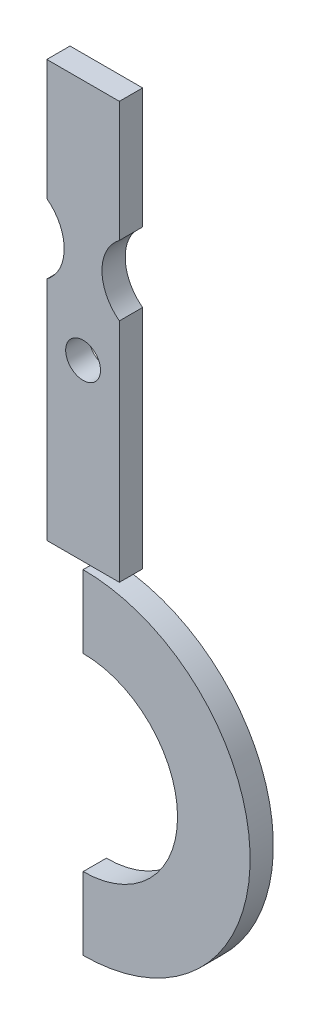
ISO-10303-21;
HEADER;
FILE_DESCRIPTION(('STEP AP214'),'2;1');
FILE_NAME('part.step','',(''),(''),'','','');
FILE_SCHEMA(('AUTOMOTIVE_DESIGN { 1 0 10303 214 1 1 1 1 }'));
ENDSEC;
DATA;
#1=APPLICATION_CONTEXT('core data for automotive mechanical design processes');
#2=APPLICATION_PROTOCOL_DEFINITION('international standard','automotive_design',2000,#1);
#3=PRODUCT_CONTEXT('',#1,'mechanical');
#4=PRODUCT('Part','Part','',(#3));
#5=PRODUCT_RELATED_PRODUCT_CATEGORY('part','',(#4));
#6=PRODUCT_DEFINITION_FORMATION('','',#4);
#7=PRODUCT_DEFINITION_CONTEXT('part definition',#1,'design');
#8=PRODUCT_DEFINITION('design','',#6,#7);
#9=PRODUCT_DEFINITION_SHAPE('','',#8);
#10=(LENGTH_UNIT() NAMED_UNIT(*) SI_UNIT(.MILLI.,.METRE.));
#11=(NAMED_UNIT(*) PLANE_ANGLE_UNIT() SI_UNIT($,.RADIAN.));
#12=(NAMED_UNIT(*) SI_UNIT($,.STERADIAN.) SOLID_ANGLE_UNIT());
#13=UNCERTAINTY_MEASURE_WITH_UNIT(LENGTH_MEASURE(1.E-05),#10,'distance_accuracy_value','');
#14=(GEOMETRIC_REPRESENTATION_CONTEXT(3) GLOBAL_UNCERTAINTY_ASSIGNED_CONTEXT((#13)) GLOBAL_UNIT_ASSIGNED_CONTEXT((#10,
#11,#12)) REPRESENTATION_CONTEXT('',''));
#15=CARTESIAN_POINT('',(0.,0.,0.));
#16=DIRECTION('',(0.,0.,1.));
#17=DIRECTION('',(1.,0.,0.));
#18=AXIS2_PLACEMENT_3D('',#15,#16,#17);
#19=CARTESIAN_POINT('',(0.,-185.,8.));
#20=DIRECTION('',(0.,0.,-1.));
#21=DIRECTION('',(-1.,0.,0.));
#22=AXIS2_PLACEMENT_3D('',#19,#20,#21);
#23=CYLINDRICAL_SURFACE('',#22,32.5433285968467);
#24=CARTESIAN_POINT('',(0.,-185.,0.));
#25=DIRECTION('',(0.,0.,1.));
#26=DIRECTION('',(1.,0.,0.));
#27=AXIS2_PLACEMENT_3D('',#24,#25,#26);
#28=CIRCLE('',#27,32.5433285968467);
#29=CARTESIAN_POINT('',(0.,-152.456671403153,0.));
#30=VERTEX_POINT('',#29);
#31=CARTESIAN_POINT('',(0.,-217.543328596847,0.));
#32=VERTEX_POINT('',#31);
#33=EDGE_CURVE('E133',#30,#32,#28,.F.);
#34=ORIENTED_EDGE('',*,*,#33,.T.);
#35=DIRECTION('',(0.,0.,-1.));
#36=VECTOR('',#35,1.);
#37=CARTESIAN_POINT('',(0.,-217.543328596847,8.));
#38=LINE('',#37,#36);
#39=CARTESIAN_POINT('',(0.,-217.543328596847,8.));
#40=VERTEX_POINT('',#39);
#41=EDGE_CURVE('E13',#40,#32,#38,.T.);
#42=ORIENTED_EDGE('',*,*,#41,.F.);
#43=CARTESIAN_POINT('',(0.,-185.,8.));
#44=DIRECTION('',(0.,0.,1.));
#45=DIRECTION('',(1.,0.,0.));
#46=AXIS2_PLACEMENT_3D('',#43,#44,#45);
#47=CIRCLE('',#46,32.5433285968467);
#48=CARTESIAN_POINT('',(0.,-152.456671403153,8.));
#49=VERTEX_POINT('',#48);
#50=EDGE_CURVE('E104',#49,#40,#47,.F.);
#51=ORIENTED_EDGE('',*,*,#50,.F.);
#52=DIRECTION('',(0.,0.,-1.));
#53=VECTOR('',#52,1.);
#54=CARTESIAN_POINT('',(0.,-152.456671403153,8.));
#55=LINE('',#54,#53);
#56=EDGE_CURVE('E132',#49,#30,#55,.T.);
#57=ORIENTED_EDGE('',*,*,#56,.T.);
#58=EDGE_LOOP('',(#34,#42,#51,#57));
#59=FACE_BOUND('',#58,.T.);
#60=ADVANCED_FACE('F61',(#59),#23,.F.);
#61=CARTESIAN_POINT('',(0.,0.,8.));
#62=DIRECTION('',(-1.,0.,0.));
#63=DIRECTION('',(0.,-1.,0.));
#64=AXIS2_PLACEMENT_3D('',#61,#62,#63);
#65=PLANE('',#64);
#66=DIRECTION('',(0.,1.,0.));
#67=VECTOR('',#66,1.);
#68=CARTESIAN_POINT('',(0.,0.,0.));
#69=LINE('',#68,#67);
#70=CARTESIAN_POINT('',(0.,-242.543328596847,0.));
#71=VERTEX_POINT('',#70);
#72=EDGE_CURVE('E114',#71,#32,#69,.T.);
#73=ORIENTED_EDGE('',*,*,#72,.F.);
#74=DIRECTION('',(0.,0.,-1.));
#75=VECTOR('',#74,1.);
#76=CARTESIAN_POINT('',(0.,-242.543328596847,8.));
#77=LINE('',#76,#75);
#78=CARTESIAN_POINT('',(0.,-242.543328596847,8.));
#79=VERTEX_POINT('',#78);
#80=EDGE_CURVE('E70',#79,#71,#77,.T.);
#81=ORIENTED_EDGE('',*,*,#80,.F.);
#82=DIRECTION('',(0.,1.,0.));
#83=VECTOR('',#82,1.);
#84=CARTESIAN_POINT('',(0.,0.,8.));
#85=LINE('',#84,#83);
#86=EDGE_CURVE('E112',#79,#40,#85,.T.);
#87=ORIENTED_EDGE('',*,*,#86,.T.);
#88=ORIENTED_EDGE('',*,*,#41,.T.);
#89=EDGE_LOOP('',(#73,#81,#87,#88));
#90=FACE_BOUND('',#89,.T.);
#91=ADVANCED_FACE('F111',(#90),#65,.T.);
#92=CARTESIAN_POINT('',(0.,-185.,8.));
#93=DIRECTION('',(0.,0.,-1.));
#94=DIRECTION('',(-1.,0.,0.));
#95=AXIS2_PLACEMENT_3D('',#92,#93,#94);
#96=CYLINDRICAL_SURFACE('',#95,57.5433285968466);
#97=CARTESIAN_POINT('',(0.,-185.,0.));
#98=DIRECTION('',(0.,0.,1.));
#99=DIRECTION('',(1.,0.,0.));
#100=AXIS2_PLACEMENT_3D('',#97,#98,#99);
#101=CIRCLE('',#100,57.5433285968466);
#102=CARTESIAN_POINT('',(0.,-127.456671403153,0.));
#103=VERTEX_POINT('',#102);
#104=EDGE_CURVE('E93',#71,#103,#101,.T.);
#105=ORIENTED_EDGE('',*,*,#104,.T.);
#106=DIRECTION('',(0.,0.,-1.));
#107=VECTOR('',#106,1.);
#108=CARTESIAN_POINT('',(0.,-127.456671403153,8.));
#109=LINE('',#108,#107);
#110=CARTESIAN_POINT('',(0.,-127.456671403153,8.));
#111=VERTEX_POINT('',#110);
#112=EDGE_CURVE('E116',#111,#103,#109,.T.);
#113=ORIENTED_EDGE('',*,*,#112,.F.);
#114=CARTESIAN_POINT('',(0.,-185.,8.));
#115=DIRECTION('',(0.,0.,1.));
#116=DIRECTION('',(1.,0.,0.));
#117=AXIS2_PLACEMENT_3D('',#114,#115,#116);
#118=CIRCLE('',#117,57.5433285968466);
#119=EDGE_CURVE('E117',#79,#111,#118,.T.);
#120=ORIENTED_EDGE('',*,*,#119,.F.);
#121=ORIENTED_EDGE('',*,*,#80,.T.);
#122=EDGE_LOOP('',(#105,#113,#120,#121));
#123=FACE_BOUND('',#122,.T.);
#124=ADVANCED_FACE('F118',(#123),#96,.T.);
#125=CARTESIAN_POINT('',(0.,0.,8.));
#126=DIRECTION('',(1.,0.,0.));
#127=DIRECTION('',(0.,1.,0.));
#128=AXIS2_PLACEMENT_3D('',#125,#126,#127);
#129=PLANE('',#128);
#130=DIRECTION('',(0.,-1.,0.));
#131=VECTOR('',#130,1.);
#132=CARTESIAN_POINT('',(0.,0.,0.));
#133=LINE('',#132,#131);
#134=EDGE_CURVE('E99',#103,#30,#133,.T.);
#135=ORIENTED_EDGE('',*,*,#134,.T.);
#136=ORIENTED_EDGE('',*,*,#56,.F.);
#137=DIRECTION('',(0.,-1.,0.));
#138=VECTOR('',#137,1.);
#139=CARTESIAN_POINT('',(0.,0.,8.));
#140=LINE('',#139,#138);
#141=EDGE_CURVE('E78',#111,#49,#140,.T.);
#142=ORIENTED_EDGE('',*,*,#141,.F.);
#143=ORIENTED_EDGE('',*,*,#112,.T.);
#144=EDGE_LOOP('',(#135,#136,#142,#143));
#145=FACE_BOUND('',#144,.T.);
#146=ADVANCED_FACE('F146',(#145),#129,.F.);
#147=CARTESIAN_POINT('',(0.,0.,8.));
#148=DIRECTION('',(0.,0.,1.));
#149=DIRECTION('',(1.,0.,0.));
#150=AXIS2_PLACEMENT_3D('',#147,#148,#149);
#151=PLANE('',#150);
#152=ORIENTED_EDGE('',*,*,#50,.T.);
#153=ORIENTED_EDGE('',*,*,#86,.F.);
#154=ORIENTED_EDGE('',*,*,#119,.T.);
#155=ORIENTED_EDGE('',*,*,#141,.T.);
#156=EDGE_LOOP('',(#152,#153,#154,#155));
#157=FACE_BOUND('',#156,.T.);
#158=ADVANCED_FACE('F121',(#157),#151,.T.);
#159=CARTESIAN_POINT('',(0.,0.,0.));
#160=DIRECTION('',(0.,0.,1.));
#161=DIRECTION('',(1.,0.,0.));
#162=AXIS2_PLACEMENT_3D('',#159,#160,#161);
#163=PLANE('',#162);
#164=ORIENTED_EDGE('',*,*,#33,.F.);
#165=ORIENTED_EDGE('',*,*,#134,.F.);
#166=ORIENTED_EDGE('',*,*,#104,.F.);
#167=ORIENTED_EDGE('',*,*,#72,.T.);
#168=EDGE_LOOP('',(#164,#165,#166,#167));
#169=FACE_BOUND('',#168,.T.);
#170=ADVANCED_FACE('F149',(#169),#163,.F.);
#171=CLOSED_SHELL('',(#60,#91,#124,#146,#158,#170));
#172=MANIFOLD_SOLID_BREP('B2',#171);
#173=CARTESIAN_POINT('',(21.5,-35.,8.));
#174=DIRECTION('',(0.,0.,-1.));
#175=DIRECTION('',(-1.,0.,0.));
#176=AXIS2_PLACEMENT_3D('',#173,#174,#175);
#177=CYLINDRICAL_SURFACE('',#176,15.);
#178=CARTESIAN_POINT('',(21.5,-35.,0.));
#179=DIRECTION('',(0.,0.,1.));
#180=DIRECTION('',(1.,0.,0.));
#181=AXIS2_PLACEMENT_3D('',#178,#179,#180);
#182=CIRCLE('',#181,15.);
#183=CARTESIAN_POINT('',(12.5,-23.,0.));
#184=VERTEX_POINT('',#183);
#185=CARTESIAN_POINT('',(12.5,-47.,0.));
#186=VERTEX_POINT('',#185);
#187=EDGE_CURVE('E367',#184,#186,#182,.T.);
#188=ORIENTED_EDGE('',*,*,#187,.F.);
#189=DIRECTION('',(0.,0.,-1.));
#190=VECTOR('',#189,1.);
#191=CARTESIAN_POINT('',(12.5,-23.,8.));
#192=LINE('',#191,#190);
#193=CARTESIAN_POINT('',(12.5,-23.,8.));
#194=VERTEX_POINT('',#193);
#195=EDGE_CURVE('E59',#194,#184,#192,.T.);
#196=ORIENTED_EDGE('',*,*,#195,.F.);
#197=CARTESIAN_POINT('',(21.5,-35.,8.));
#198=DIRECTION('',(0.,0.,1.));
#199=DIRECTION('',(1.,0.,0.));
#200=AXIS2_PLACEMENT_3D('',#197,#198,#199);
#201=CIRCLE('',#200,15.);
#202=CARTESIAN_POINT('',(12.5,-47.,8.));
#203=VERTEX_POINT('',#202);
#204=EDGE_CURVE('E327',#194,#203,#201,.T.);
#205=ORIENTED_EDGE('',*,*,#204,.T.);
#206=DIRECTION('',(0.,0.,-1.));
#207=VECTOR('',#206,1.);
#208=CARTESIAN_POINT('',(12.5,-47.,8.));
#209=LINE('',#208,#207);
#210=EDGE_CURVE('E225',#203,#186,#209,.T.);
#211=ORIENTED_EDGE('',*,*,#210,.T.);
#212=EDGE_LOOP('',(#188,#196,#205,#211));
#213=FACE_BOUND('',#212,.T.);
#214=ADVANCED_FACE('F208',(#213),#177,.F.);
#215=CARTESIAN_POINT('',(12.5,0.,8.));
#216=DIRECTION('',(1.,0.,0.));
#217=DIRECTION('',(0.,1.,0.));
#218=AXIS2_PLACEMENT_3D('',#215,#216,#217);
#219=PLANE('',#218);
#220=DIRECTION('',(0.,-1.,0.));
#221=VECTOR('',#220,1.);
#222=CARTESIAN_POINT('',(12.5,0.,0.));
#223=LINE('',#222,#221);
#224=CARTESIAN_POINT('',(12.5,18.5,0.));
#225=VERTEX_POINT('',#224);
#226=EDGE_CURVE('E365',#225,#184,#223,.T.);
#227=ORIENTED_EDGE('',*,*,#226,.F.);
#228=DIRECTION('',(0.,0.,-1.));
#229=VECTOR('',#228,1.);
#230=CARTESIAN_POINT('',(12.5,18.5,8.));
#231=LINE('',#230,#229);
#232=CARTESIAN_POINT('',(12.5,18.5,8.));
#233=VERTEX_POINT('',#232);
#234=EDGE_CURVE('E217',#233,#225,#231,.T.);
#235=ORIENTED_EDGE('',*,*,#234,.F.);
#236=DIRECTION('',(0.,-1.,0.));
#237=VECTOR('',#236,1.);
#238=CARTESIAN_POINT('',(12.5,0.,8.));
#239=LINE('',#238,#237);
#240=EDGE_CURVE('E324',#233,#194,#239,.T.);
#241=ORIENTED_EDGE('',*,*,#240,.T.);
#242=ORIENTED_EDGE('',*,*,#195,.T.);
#243=EDGE_LOOP('',(#227,#235,#241,#242));
#244=FACE_BOUND('',#243,.T.);
#245=ADVANCED_FACE('F366',(#244),#219,.T.);
#246=CARTESIAN_POINT('',(0.,18.5,8.));
#247=DIRECTION('',(0.,1.,0.));
#248=DIRECTION('',(0.,0.,1.));
#249=AXIS2_PLACEMENT_3D('',#246,#247,#248);
#250=PLANE('',#249);
#251=DIRECTION('',(1.,0.,0.));
#252=VECTOR('',#251,1.);
#253=CARTESIAN_POINT('',(0.,18.5,0.));
#254=LINE('',#253,#252);
#255=CARTESIAN_POINT('',(-12.5,18.5,0.));
#256=VERTEX_POINT('',#255);
#257=EDGE_CURVE('E359',#256,#225,#254,.T.);
#258=ORIENTED_EDGE('',*,*,#257,.F.);
#259=DIRECTION('',(0.,0.,-1.));
#260=VECTOR('',#259,1.);
#261=CARTESIAN_POINT('',(-12.5,18.5,8.));
#262=LINE('',#261,#260);
#263=CARTESIAN_POINT('',(-12.5,18.5,8.));
#264=VERTEX_POINT('',#263);
#265=EDGE_CURVE('E353',#264,#256,#262,.T.);
#266=ORIENTED_EDGE('',*,*,#265,.F.);
#267=DIRECTION('',(1.,0.,0.));
#268=VECTOR('',#267,1.);
#269=CARTESIAN_POINT('',(0.,18.5,8.));
#270=LINE('',#269,#268);
#271=EDGE_CURVE('E317',#264,#233,#270,.T.);
#272=ORIENTED_EDGE('',*,*,#271,.T.);
#273=ORIENTED_EDGE('',*,*,#234,.T.);
#274=EDGE_LOOP('',(#258,#266,#272,#273));
#275=FACE_BOUND('',#274,.T.);
#276=ADVANCED_FACE('F357',(#275),#250,.T.);
#277=CARTESIAN_POINT('',(-12.5,0.,8.));
#278=DIRECTION('',(-1.,0.,0.));
#279=DIRECTION('',(0.,0.,1.));
#280=AXIS2_PLACEMENT_3D('',#277,#278,#279);
#281=PLANE('',#280);
#282=DIRECTION('',(0.,1.,0.));
#283=VECTOR('',#282,1.);
#284=CARTESIAN_POINT('',(-12.5,0.,0.));
#285=LINE('',#284,#283);
#286=CARTESIAN_POINT('',(-12.5,-23.,0.));
#287=VERTEX_POINT('',#286);
#288=EDGE_CURVE('E372',#287,#256,#285,.T.);
#289=ORIENTED_EDGE('',*,*,#288,.F.);
#290=DIRECTION('',(0.,0.,-1.));
#291=VECTOR('',#290,1.);
#292=CARTESIAN_POINT('',(-12.5,-23.,8.));
#293=LINE('',#292,#291);
#294=CARTESIAN_POINT('',(-12.5,-23.,8.));
#295=VERTEX_POINT('',#294);
#296=EDGE_CURVE('E351',#295,#287,#293,.T.);
#297=ORIENTED_EDGE('',*,*,#296,.F.);
#298=DIRECTION('',(0.,1.,0.));
#299=VECTOR('',#298,1.);
#300=CARTESIAN_POINT('',(-12.5,0.,8.));
#301=LINE('',#300,#299);
#302=EDGE_CURVE('E313',#295,#264,#301,.T.);
#303=ORIENTED_EDGE('',*,*,#302,.T.);
#304=ORIENTED_EDGE('',*,*,#265,.T.);
#305=EDGE_LOOP('',(#289,#297,#303,#304));
#306=FACE_BOUND('',#305,.T.);
#307=ADVANCED_FACE('F382',(#306),#281,.T.);
#308=CARTESIAN_POINT('',(-21.5,-35.,8.));
#309=DIRECTION('',(0.,0.,-1.));
#310=DIRECTION('',(-1.,0.,0.));
#311=AXIS2_PLACEMENT_3D('',#308,#309,#310);
#312=CYLINDRICAL_SURFACE('',#311,15.);
#313=CARTESIAN_POINT('',(-21.5,-35.,0.));
#314=DIRECTION('',(0.,0.,1.));
#315=DIRECTION('',(1.,0.,0.));
#316=AXIS2_PLACEMENT_3D('',#313,#314,#315);
#317=CIRCLE('',#316,15.);
#318=CARTESIAN_POINT('',(-12.5,-47.,0.));
#319=VERTEX_POINT('',#318);
#320=EDGE_CURVE('E374',#287,#319,#317,.F.);
#321=ORIENTED_EDGE('',*,*,#320,.T.);
#322=DIRECTION('',(0.,0.,-1.));
#323=VECTOR('',#322,1.);
#324=CARTESIAN_POINT('',(-12.5,-47.,8.));
#325=LINE('',#324,#323);
#326=CARTESIAN_POINT('',(-12.5,-47.,8.));
#327=VERTEX_POINT('',#326);
#328=EDGE_CURVE('E295',#327,#319,#325,.T.);
#329=ORIENTED_EDGE('',*,*,#328,.F.);
#330=CARTESIAN_POINT('',(-21.5,-35.,8.));
#331=DIRECTION('',(0.,0.,1.));
#332=DIRECTION('',(1.,0.,0.));
#333=AXIS2_PLACEMENT_3D('',#330,#331,#332);
#334=CIRCLE('',#333,15.);
#335=EDGE_CURVE('E283',#295,#327,#334,.F.);
#336=ORIENTED_EDGE('',*,*,#335,.F.);
#337=ORIENTED_EDGE('',*,*,#296,.T.);
#338=EDGE_LOOP('',(#321,#329,#336,#337));
#339=FACE_BOUND('',#338,.T.);
#340=ADVANCED_FACE('F380',(#339),#312,.F.);
#341=CARTESIAN_POINT('',(-12.5,0.,8.));
#342=DIRECTION('',(1.,0.,0.));
#343=DIRECTION('',(0.,1.,0.));
#344=AXIS2_PLACEMENT_3D('',#341,#342,#343);
#345=PLANE('',#344);
#346=DIRECTION('',(0.,-1.,0.));
#347=VECTOR('',#346,1.);
#348=CARTESIAN_POINT('',(-12.5,0.,0.));
#349=LINE('',#348,#347);
#350=CARTESIAN_POINT('',(-12.5,-125.,0.));
#351=VERTEX_POINT('',#350);
#352=EDGE_CURVE('E292',#319,#351,#349,.T.);
#353=ORIENTED_EDGE('',*,*,#352,.T.);
#354=DIRECTION('',(0.,0.,-1.));
#355=VECTOR('',#354,1.);
#356=CARTESIAN_POINT('',(-12.5,-125.,8.));
#357=LINE('',#356,#355);
#358=CARTESIAN_POINT('',(-12.5,-125.,8.));
#359=VERTEX_POINT('',#358);
#360=EDGE_CURVE('E290',#359,#351,#357,.T.);
#361=ORIENTED_EDGE('',*,*,#360,.F.);
#362=DIRECTION('',(0.,-1.,0.));
#363=VECTOR('',#362,1.);
#364=CARTESIAN_POINT('',(-12.5,0.,8.));
#365=LINE('',#364,#363);
#366=EDGE_CURVE('E275',#327,#359,#365,.T.);
#367=ORIENTED_EDGE('',*,*,#366,.F.);
#368=ORIENTED_EDGE('',*,*,#328,.T.);
#369=EDGE_LOOP('',(#353,#361,#367,#368));
#370=FACE_BOUND('',#369,.T.);
#371=ADVANCED_FACE('F291',(#370),#345,.F.);
#372=CARTESIAN_POINT('',(0.,-125.,8.));
#373=DIRECTION('',(0.,-1.,0.));
#374=DIRECTION('',(0.,0.,-1.));
#375=AXIS2_PLACEMENT_3D('',#372,#373,#374);
#376=PLANE('',#375);
#377=DIRECTION('',(-1.,0.,0.));
#378=VECTOR('',#377,1.);
#379=CARTESIAN_POINT('',(0.,-125.,0.));
#380=LINE('',#379,#378);
#381=CARTESIAN_POINT('',(12.5,-125.,0.));
#382=VERTEX_POINT('',#381);
#383=EDGE_CURVE('E337',#382,#351,#380,.T.);
#384=ORIENTED_EDGE('',*,*,#383,.F.);
#385=DIRECTION('',(0.,0.,-1.));
#386=VECTOR('',#385,1.);
#387=CARTESIAN_POINT('',(12.5,-125.,8.));
#388=LINE('',#387,#386);
#389=CARTESIAN_POINT('',(12.5,-125.,8.));
#390=VERTEX_POINT('',#389);
#391=EDGE_CURVE('E250',#390,#382,#388,.T.);
#392=ORIENTED_EDGE('',*,*,#391,.F.);
#393=DIRECTION('',(-1.,0.,0.));
#394=VECTOR('',#393,1.);
#395=CARTESIAN_POINT('',(0.,-125.,8.));
#396=LINE('',#395,#394);
#397=EDGE_CURVE('E280',#390,#359,#396,.T.);
#398=ORIENTED_EDGE('',*,*,#397,.T.);
#399=ORIENTED_EDGE('',*,*,#360,.T.);
#400=EDGE_LOOP('',(#384,#392,#398,#399));
#401=FACE_BOUND('',#400,.T.);
#402=ADVANCED_FACE('F297',(#401),#376,.T.);
#403=CARTESIAN_POINT('',(0.,-65.,8.));
#404=DIRECTION('',(0.,0.,-1.));
#405=DIRECTION('',(-1.,0.,0.));
#406=AXIS2_PLACEMENT_3D('',#403,#404,#405);
#407=CYLINDRICAL_SURFACE('',#406,6.);
#408=CARTESIAN_POINT('',(0.,-65.,8.));
#409=DIRECTION('',(0.,0.,1.));
#410=DIRECTION('',(1.,0.,0.));
#411=AXIS2_PLACEMENT_3D('',#408,#409,#410);
#412=CIRCLE('',#411,6.);
#413=CARTESIAN_POINT('',(6.,-65.,8.));
#414=VERTEX_POINT('',#413);
#415=EDGE_CURVE('E329',#414,#414,#412,.T.);
#416=ORIENTED_EDGE('',*,*,#415,.T.);
#417=EDGE_LOOP('',(#416));
#418=FACE_BOUND('',#417,.T.);
#419=CARTESIAN_POINT('',(0.,-65.,0.));
#420=DIRECTION('',(0.,0.,1.));
#421=DIRECTION('',(1.,0.,0.));
#422=AXIS2_PLACEMENT_3D('',#419,#420,#421);
#423=CIRCLE('',#422,6.);
#424=CARTESIAN_POINT('',(6.,-65.,0.));
#425=VERTEX_POINT('',#424);
#426=EDGE_CURVE('E487',#425,#425,#423,.T.);
#427=ORIENTED_EDGE('',*,*,#426,.F.);
#428=EDGE_LOOP('',(#427));
#429=FACE_BOUND('',#428,.T.);
#430=ADVANCED_FACE('F210',(#418,#429),#407,.F.);
#431=CARTESIAN_POINT('',(12.5,0.,8.));
#432=DIRECTION('',(1.,0.,0.));
#433=DIRECTION('',(0.,1.,0.));
#434=AXIS2_PLACEMENT_3D('',#431,#432,#433);
#435=PLANE('',#434);
#436=DIRECTION('',(0.,-1.,0.));
#437=VECTOR('',#436,1.);
#438=CARTESIAN_POINT('',(12.5,0.,0.));
#439=LINE('',#438,#437);
#440=EDGE_CURVE('E332',#186,#382,#439,.T.);
#441=ORIENTED_EDGE('',*,*,#440,.F.);
#442=ORIENTED_EDGE('',*,*,#210,.F.);
#443=DIRECTION('',(0.,-1.,0.));
#444=VECTOR('',#443,1.);
#445=CARTESIAN_POINT('',(12.5,0.,8.));
#446=LINE('',#445,#444);
#447=EDGE_CURVE('E299',#203,#390,#446,.T.);
#448=ORIENTED_EDGE('',*,*,#447,.T.);
#449=ORIENTED_EDGE('',*,*,#391,.T.);
#450=EDGE_LOOP('',(#441,#442,#448,#449));
#451=FACE_BOUND('',#450,.T.);
#452=ADVANCED_FACE('F399',(#451),#435,.T.);
#453=CARTESIAN_POINT('',(0.,0.,8.));
#454=DIRECTION('',(0.,0.,1.));
#455=DIRECTION('',(1.,0.,0.));
#456=AXIS2_PLACEMENT_3D('',#453,#454,#455);
#457=PLANE('',#456);
#458=ORIENTED_EDGE('',*,*,#415,.F.);
#459=EDGE_LOOP('',(#458));
#460=FACE_BOUND('',#459,.T.);
#461=ORIENTED_EDGE('',*,*,#204,.F.);
#462=ORIENTED_EDGE('',*,*,#240,.F.);
#463=ORIENTED_EDGE('',*,*,#271,.F.);
#464=ORIENTED_EDGE('',*,*,#302,.F.);
#465=ORIENTED_EDGE('',*,*,#335,.T.);
#466=ORIENTED_EDGE('',*,*,#366,.T.);
#467=ORIENTED_EDGE('',*,*,#397,.F.);
#468=ORIENTED_EDGE('',*,*,#447,.F.);
#469=EDGE_LOOP('',(#461,#462,#463,#464,#465,#466,#467,#468));
#470=FACE_BOUND('',#469,.T.);
#471=ADVANCED_FACE('F277',(#460,#470),#457,.T.);
#472=CARTESIAN_POINT('',(0.,0.,0.));
#473=DIRECTION('',(0.,0.,1.));
#474=DIRECTION('',(1.,0.,0.));
#475=AXIS2_PLACEMENT_3D('',#472,#473,#474);
#476=PLANE('',#475);
#477=ORIENTED_EDGE('',*,*,#426,.T.);
#478=EDGE_LOOP('',(#477));
#479=FACE_BOUND('',#478,.T.);
#480=ORIENTED_EDGE('',*,*,#187,.T.);
#481=ORIENTED_EDGE('',*,*,#440,.T.);
#482=ORIENTED_EDGE('',*,*,#383,.T.);
#483=ORIENTED_EDGE('',*,*,#352,.F.);
#484=ORIENTED_EDGE('',*,*,#320,.F.);
#485=ORIENTED_EDGE('',*,*,#288,.T.);
#486=ORIENTED_EDGE('',*,*,#257,.T.);
#487=ORIENTED_EDGE('',*,*,#226,.T.);
#488=EDGE_LOOP('',(#480,#481,#482,#483,#484,#485,#486,#487));
#489=FACE_BOUND('',#488,.T.);
#490=ADVANCED_FACE('F369',(#479,#489),#476,.F.);
#491=CLOSED_SHELL('',(#214,#245,#276,#307,#340,#371,#402,#430,#452,#471,#490));
#492=MANIFOLD_SOLID_BREP('B7',#491);
#493=ADVANCED_BREP_SHAPE_REPRESENTATION('',(#18,#172,#492),#14);
#494=SHAPE_DEFINITION_REPRESENTATION(#9,#493);
ENDSEC;
END-ISO-10303-21;
